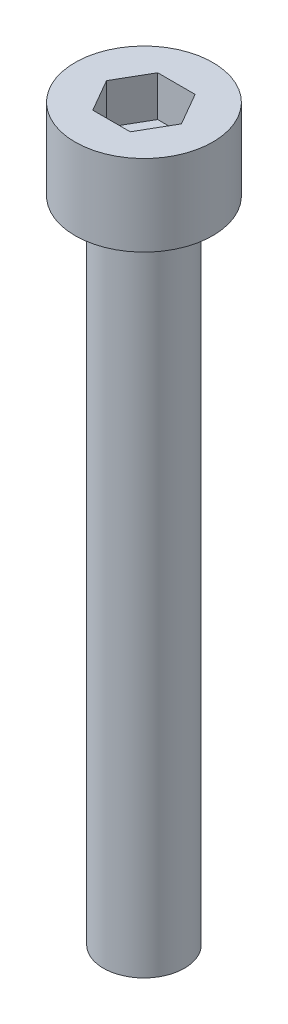
ISO-10303-21;
HEADER;
FILE_DESCRIPTION(('STEP AP214'),'2;1');
FILE_NAME('part.step','',(''),(''),'','','');
FILE_SCHEMA(('AUTOMOTIVE_DESIGN { 1 0 10303 214 1 1 1 1 }'));
ENDSEC;
DATA;
#1=APPLICATION_CONTEXT('core data for automotive mechanical design processes');
#2=APPLICATION_PROTOCOL_DEFINITION('international standard','automotive_design',2000,#1);
#3=PRODUCT_CONTEXT('',#1,'mechanical');
#4=PRODUCT('Part','Part','',(#3));
#5=PRODUCT_RELATED_PRODUCT_CATEGORY('part','',(#4));
#6=PRODUCT_DEFINITION_FORMATION('','',#4);
#7=PRODUCT_DEFINITION_CONTEXT('part definition',#1,'design');
#8=PRODUCT_DEFINITION('design','',#6,#7);
#9=PRODUCT_DEFINITION_SHAPE('','',#8);
#10=(LENGTH_UNIT() NAMED_UNIT(*) SI_UNIT(.MILLI.,.METRE.));
#11=(NAMED_UNIT(*) PLANE_ANGLE_UNIT() SI_UNIT($,.RADIAN.));
#12=(NAMED_UNIT(*) SI_UNIT($,.STERADIAN.) SOLID_ANGLE_UNIT());
#13=UNCERTAINTY_MEASURE_WITH_UNIT(LENGTH_MEASURE(1.E-05),#10,'distance_accuracy_value','');
#14=(GEOMETRIC_REPRESENTATION_CONTEXT(3) GLOBAL_UNCERTAINTY_ASSIGNED_CONTEXT((#13)) GLOBAL_UNIT_ASSIGNED_CONTEXT((#10,
#11,#12)) REPRESENTATION_CONTEXT('',''));
#15=CARTESIAN_POINT('',(0.,0.,0.));
#16=DIRECTION('',(0.,0.,1.));
#17=DIRECTION('',(1.,0.,0.));
#18=AXIS2_PLACEMENT_3D('',#15,#16,#17);
#19=CARTESIAN_POINT('',(0.,5.,0.));
#20=DIRECTION('',(0.,-1.,0.));
#21=DIRECTION('',(0.,0.,-1.));
#22=AXIS2_PLACEMENT_3D('',#19,#20,#21);
#23=CYLINDRICAL_SURFACE('',#22,4.25);
#24=CARTESIAN_POINT('',(0.,5.,0.));
#25=DIRECTION('',(0.,1.,0.));
#26=DIRECTION('',(0.,0.,1.));
#27=AXIS2_PLACEMENT_3D('',#24,#25,#26);
#28=CIRCLE('',#27,4.25);
#29=CARTESIAN_POINT('',(0.,5.,4.25));
#30=VERTEX_POINT('',#29);
#31=EDGE_CURVE('E43',#30,#30,#28,.T.);
#32=ORIENTED_EDGE('',*,*,#31,.F.);
#33=EDGE_LOOP('',(#32));
#34=FACE_BOUND('',#33,.T.);
#35=CARTESIAN_POINT('',(0.,0.,0.));
#36=DIRECTION('',(0.,1.,0.));
#37=DIRECTION('',(0.,0.,1.));
#38=AXIS2_PLACEMENT_3D('',#35,#36,#37);
#39=CIRCLE('',#38,4.25);
#40=CARTESIAN_POINT('',(0.,0.,4.25));
#41=VERTEX_POINT('',#40);
#42=EDGE_CURVE('E38',#41,#41,#39,.T.);
#43=ORIENTED_EDGE('',*,*,#42,.T.);
#44=EDGE_LOOP('',(#43));
#45=FACE_BOUND('',#44,.T.);
#46=ADVANCED_FACE('F35',(#34,#45),#23,.T.);
#47=CARTESIAN_POINT('',(0.,5.,0.));
#48=DIRECTION('',(0.,1.,0.));
#49=DIRECTION('',(0.,0.,1.));
#50=AXIS2_PLACEMENT_3D('',#47,#48,#49);
#51=PLANE('',#50);
#52=DIRECTION('',(0.5,0.,-0.866025403784439));
#53=VECTOR('',#52,1.);
#54=CARTESIAN_POINT('',(1.15470053837925,5.,2.));
#55=LINE('',#54,#53);
#56=CARTESIAN_POINT('',(1.15470053837925,5.,2.));
#57=VERTEX_POINT('',#56);
#58=CARTESIAN_POINT('',(2.3094010767585,5.,0.));
#59=VERTEX_POINT('',#58);
#60=EDGE_CURVE('E51',#57,#59,#55,.T.);
#61=ORIENTED_EDGE('',*,*,#60,.F.);
#62=DIRECTION('',(1.,0.,0.));
#63=VECTOR('',#62,1.);
#64=CARTESIAN_POINT('',(-1.15470053837925,5.,2.));
#65=LINE('',#64,#63);
#66=CARTESIAN_POINT('',(-1.15470053837925,5.,2.));
#67=VERTEX_POINT('',#66);
#68=EDGE_CURVE('E135',#67,#57,#65,.T.);
#69=ORIENTED_EDGE('',*,*,#68,.F.);
#70=DIRECTION('',(0.5,0.,0.866025403784438));
#71=VECTOR('',#70,1.);
#72=CARTESIAN_POINT('',(-2.3094010767585,5.,0.));
#73=LINE('',#72,#71);
#74=CARTESIAN_POINT('',(-2.3094010767585,5.,0.));
#75=VERTEX_POINT('',#74);
#76=EDGE_CURVE('E133',#75,#67,#73,.T.);
#77=ORIENTED_EDGE('',*,*,#76,.F.);
#78=DIRECTION('',(-0.5,0.,0.866025403784439));
#79=VECTOR('',#78,1.);
#80=CARTESIAN_POINT('',(-1.15470053837925,5.,-2.));
#81=LINE('',#80,#79);
#82=CARTESIAN_POINT('',(-1.15470053837925,5.,-2.));
#83=VERTEX_POINT('',#82);
#84=EDGE_CURVE('E99',#83,#75,#81,.T.);
#85=ORIENTED_EDGE('',*,*,#84,.F.);
#86=DIRECTION('',(-1.,0.,0.));
#87=VECTOR('',#86,1.);
#88=CARTESIAN_POINT('',(1.15470053837925,5.,-2.));
#89=LINE('',#88,#87);
#90=CARTESIAN_POINT('',(1.15470053837925,5.,-2.));
#91=VERTEX_POINT('',#90);
#92=EDGE_CURVE('E129',#91,#83,#89,.T.);
#93=ORIENTED_EDGE('',*,*,#92,.F.);
#94=DIRECTION('',(-0.5,0.,-0.866025403784438));
#95=VECTOR('',#94,1.);
#96=CARTESIAN_POINT('',(2.3094010767585,5.,0.));
#97=LINE('',#96,#95);
#98=EDGE_CURVE('E125',#59,#91,#97,.T.);
#99=ORIENTED_EDGE('',*,*,#98,.F.);
#100=EDGE_LOOP('',(#61,#69,#77,#85,#93,#99));
#101=FACE_BOUND('',#100,.T.);
#102=ORIENTED_EDGE('',*,*,#31,.T.);
#103=EDGE_LOOP('',(#102));
#104=FACE_BOUND('',#103,.T.);
#105=ADVANCED_FACE('F153',(#101,#104),#51,.T.);
#106=CARTESIAN_POINT('',(0.,0.,0.));
#107=DIRECTION('',(0.,1.,0.));
#108=DIRECTION('',(0.,0.,1.));
#109=AXIS2_PLACEMENT_3D('',#106,#107,#108);
#110=PLANE('',#109);
#111=CARTESIAN_POINT('',(0.,0.,0.));
#112=DIRECTION('',(0.,-1.,0.));
#113=DIRECTION('',(0.,0.,-1.));
#114=AXIS2_PLACEMENT_3D('',#111,#112,#113);
#115=CIRCLE('',#114,2.5);
#116=CARTESIAN_POINT('',(0.,0.,-2.5));
#117=VERTEX_POINT('',#116);
#118=EDGE_CURVE('E11',#117,#117,#115,.T.);
#119=ORIENTED_EDGE('',*,*,#118,.F.);
#120=EDGE_LOOP('',(#119));
#121=FACE_BOUND('',#120,.T.);
#122=ORIENTED_EDGE('',*,*,#42,.F.);
#123=EDGE_LOOP('',(#122));
#124=FACE_BOUND('',#123,.T.);
#125=ADVANCED_FACE('F150',(#121,#124),#110,.F.);
#126=CARTESIAN_POINT('',(1.15470053837925,2.5,2.));
#127=DIRECTION('',(0.866025403784439,0.,0.5));
#128=DIRECTION('',(0.5,0.,-0.866025403784439));
#129=AXIS2_PLACEMENT_3D('',#126,#127,#128);
#130=PLANE('',#129);
#131=ORIENTED_EDGE('',*,*,#60,.T.);
#132=DIRECTION('',(0.,1.,0.));
#133=VECTOR('',#132,1.);
#134=CARTESIAN_POINT('',(2.3094010767585,2.5,0.));
#135=LINE('',#134,#133);
#136=CARTESIAN_POINT('',(2.3094010767585,2.5,0.));
#137=VERTEX_POINT('',#136);
#138=EDGE_CURVE('E81',#137,#59,#135,.T.);
#139=ORIENTED_EDGE('',*,*,#138,.F.);
#140=DIRECTION('',(0.5,0.,-0.866025403784439));
#141=VECTOR('',#140,1.);
#142=CARTESIAN_POINT('',(1.15470053837925,2.5,2.));
#143=LINE('',#142,#141);
#144=CARTESIAN_POINT('',(1.15470053837925,2.5,2.));
#145=VERTEX_POINT('',#144);
#146=EDGE_CURVE('E137',#145,#137,#143,.T.);
#147=ORIENTED_EDGE('',*,*,#146,.F.);
#148=DIRECTION('',(0.,1.,0.));
#149=VECTOR('',#148,1.);
#150=CARTESIAN_POINT('',(1.15470053837925,2.5,2.));
#151=LINE('',#150,#149);
#152=EDGE_CURVE('E59',#145,#57,#151,.T.);
#153=ORIENTED_EDGE('',*,*,#152,.T.);
#154=EDGE_LOOP('',(#131,#139,#147,#153));
#155=FACE_BOUND('',#154,.T.);
#156=ADVANCED_FACE('F152',(#155),#130,.F.);
#157=CARTESIAN_POINT('',(-1.15470053837925,2.5,2.));
#158=DIRECTION('',(0.,0.,1.));
#159=DIRECTION('',(1.,0.,0.));
#160=AXIS2_PLACEMENT_3D('',#157,#158,#159);
#161=PLANE('',#160);
#162=ORIENTED_EDGE('',*,*,#68,.T.);
#163=ORIENTED_EDGE('',*,*,#152,.F.);
#164=DIRECTION('',(1.,0.,0.));
#165=VECTOR('',#164,1.);
#166=CARTESIAN_POINT('',(-1.15470053837925,2.5,2.));
#167=LINE('',#166,#165);
#168=CARTESIAN_POINT('',(-1.15470053837925,2.5,2.));
#169=VERTEX_POINT('',#168);
#170=EDGE_CURVE('E111',#169,#145,#167,.T.);
#171=ORIENTED_EDGE('',*,*,#170,.F.);
#172=DIRECTION('',(0.,1.,0.));
#173=VECTOR('',#172,1.);
#174=CARTESIAN_POINT('',(-1.15470053837925,2.5,2.));
#175=LINE('',#174,#173);
#176=EDGE_CURVE('E103',#169,#67,#175,.T.);
#177=ORIENTED_EDGE('',*,*,#176,.T.);
#178=EDGE_LOOP('',(#162,#163,#171,#177));
#179=FACE_BOUND('',#178,.T.);
#180=ADVANCED_FACE('F159',(#179),#161,.F.);
#181=CARTESIAN_POINT('',(-2.3094010767585,2.5,0.));
#182=DIRECTION('',(-0.866025403784439,0.,0.5));
#183=DIRECTION('',(0.5,0.,0.866025403784439));
#184=AXIS2_PLACEMENT_3D('',#181,#182,#183);
#185=PLANE('',#184);
#186=ORIENTED_EDGE('',*,*,#76,.T.);
#187=ORIENTED_EDGE('',*,*,#176,.F.);
#188=DIRECTION('',(0.5,0.,0.866025403784438));
#189=VECTOR('',#188,1.);
#190=CARTESIAN_POINT('',(-2.3094010767585,2.5,0.));
#191=LINE('',#190,#189);
#192=CARTESIAN_POINT('',(-2.3094010767585,2.5,0.));
#193=VERTEX_POINT('',#192);
#194=EDGE_CURVE('E107',#193,#169,#191,.T.);
#195=ORIENTED_EDGE('',*,*,#194,.F.);
#196=DIRECTION('',(0.,1.,0.));
#197=VECTOR('',#196,1.);
#198=CARTESIAN_POINT('',(-2.3094010767585,2.5,0.));
#199=LINE('',#198,#197);
#200=EDGE_CURVE('E92',#193,#75,#199,.T.);
#201=ORIENTED_EDGE('',*,*,#200,.T.);
#202=EDGE_LOOP('',(#186,#187,#195,#201));
#203=FACE_BOUND('',#202,.T.);
#204=ADVANCED_FACE('F108',(#203),#185,.F.);
#205=CARTESIAN_POINT('',(-1.15470053837925,2.5,-2.));
#206=DIRECTION('',(-0.866025403784439,0.,-0.5));
#207=DIRECTION('',(-0.5,0.,0.866025403784439));
#208=AXIS2_PLACEMENT_3D('',#205,#206,#207);
#209=PLANE('',#208);
#210=ORIENTED_EDGE('',*,*,#84,.T.);
#211=ORIENTED_EDGE('',*,*,#200,.F.);
#212=DIRECTION('',(-0.5,0.,0.866025403784439));
#213=VECTOR('',#212,1.);
#214=CARTESIAN_POINT('',(-1.15470053837925,2.5,-2.));
#215=LINE('',#214,#213);
#216=CARTESIAN_POINT('',(-1.15470053837925,2.5,-2.));
#217=VERTEX_POINT('',#216);
#218=EDGE_CURVE('E96',#217,#193,#215,.T.);
#219=ORIENTED_EDGE('',*,*,#218,.F.);
#220=DIRECTION('',(0.,1.,0.));
#221=VECTOR('',#220,1.);
#222=CARTESIAN_POINT('',(-1.15470053837925,2.5,-2.));
#223=LINE('',#222,#221);
#224=EDGE_CURVE('E104',#217,#83,#223,.T.);
#225=ORIENTED_EDGE('',*,*,#224,.T.);
#226=EDGE_LOOP('',(#210,#211,#219,#225));
#227=FACE_BOUND('',#226,.T.);
#228=ADVANCED_FACE('F94',(#227),#209,.F.);
#229=CARTESIAN_POINT('',(1.15470053837925,2.5,-2.));
#230=DIRECTION('',(0.,0.,-1.));
#231=DIRECTION('',(-1.,0.,0.));
#232=AXIS2_PLACEMENT_3D('',#229,#230,#231);
#233=PLANE('',#232);
#234=ORIENTED_EDGE('',*,*,#92,.T.);
#235=ORIENTED_EDGE('',*,*,#224,.F.);
#236=DIRECTION('',(-1.,0.,0.));
#237=VECTOR('',#236,1.);
#238=CARTESIAN_POINT('',(1.15470053837925,2.5,-2.));
#239=LINE('',#238,#237);
#240=CARTESIAN_POINT('',(1.15470053837925,2.5,-2.));
#241=VERTEX_POINT('',#240);
#242=EDGE_CURVE('E117',#241,#217,#239,.T.);
#243=ORIENTED_EDGE('',*,*,#242,.F.);
#244=DIRECTION('',(0.,1.,0.));
#245=VECTOR('',#244,1.);
#246=CARTESIAN_POINT('',(1.15470053837925,2.5,-2.));
#247=LINE('',#246,#245);
#248=EDGE_CURVE('E141',#241,#91,#247,.T.);
#249=ORIENTED_EDGE('',*,*,#248,.T.);
#250=EDGE_LOOP('',(#234,#235,#243,#249));
#251=FACE_BOUND('',#250,.T.);
#252=ADVANCED_FACE('F204',(#251),#233,.F.);
#253=CARTESIAN_POINT('',(2.3094010767585,2.5,0.));
#254=DIRECTION('',(0.866025403784438,0.,-0.5));
#255=DIRECTION('',(-0.5,0.,-0.866025403784439));
#256=AXIS2_PLACEMENT_3D('',#253,#254,#255);
#257=PLANE('',#256);
#258=ORIENTED_EDGE('',*,*,#98,.T.);
#259=ORIENTED_EDGE('',*,*,#248,.F.);
#260=DIRECTION('',(-0.5,0.,-0.866025403784438));
#261=VECTOR('',#260,1.);
#262=CARTESIAN_POINT('',(2.3094010767585,2.5,0.));
#263=LINE('',#262,#261);
#264=EDGE_CURVE('E119',#137,#241,#263,.T.);
#265=ORIENTED_EDGE('',*,*,#264,.F.);
#266=ORIENTED_EDGE('',*,*,#138,.T.);
#267=EDGE_LOOP('',(#258,#259,#265,#266));
#268=FACE_BOUND('',#267,.T.);
#269=ADVANCED_FACE('F213',(#268),#257,.F.);
#270=CARTESIAN_POINT('',(0.,2.5,0.));
#271=DIRECTION('',(0.,1.,0.));
#272=DIRECTION('',(0.,0.,1.));
#273=AXIS2_PLACEMENT_3D('',#270,#271,#272);
#274=PLANE('',#273);
#275=ORIENTED_EDGE('',*,*,#146,.T.);
#276=ORIENTED_EDGE('',*,*,#264,.T.);
#277=ORIENTED_EDGE('',*,*,#242,.T.);
#278=ORIENTED_EDGE('',*,*,#218,.T.);
#279=ORIENTED_EDGE('',*,*,#194,.T.);
#280=ORIENTED_EDGE('',*,*,#170,.T.);
#281=EDGE_LOOP('',(#275,#276,#277,#278,#279,#280));
#282=FACE_BOUND('',#281,.T.);
#283=ADVANCED_FACE('F114',(#282),#274,.T.);
#284=CARTESIAN_POINT('',(0.,-40.,0.));
#285=DIRECTION('',(0.,1.,0.));
#286=DIRECTION('',(0.,0.,1.));
#287=AXIS2_PLACEMENT_3D('',#284,#285,#286);
#288=CYLINDRICAL_SURFACE('',#287,2.5);
#289=CARTESIAN_POINT('',(0.,-40.,0.));
#290=DIRECTION('',(0.,-1.,0.));
#291=DIRECTION('',(0.,0.,-1.));
#292=AXIS2_PLACEMENT_3D('',#289,#290,#291);
#293=CIRCLE('',#292,2.5);
#294=CARTESIAN_POINT('',(0.,-40.,-2.5));
#295=VERTEX_POINT('',#294);
#296=EDGE_CURVE('E126',#295,#295,#293,.T.);
#297=ORIENTED_EDGE('',*,*,#296,.F.);
#298=EDGE_LOOP('',(#297));
#299=FACE_BOUND('',#298,.T.);
#300=ORIENTED_EDGE('',*,*,#118,.T.);
#301=EDGE_LOOP('',(#300));
#302=FACE_BOUND('',#301,.T.);
#303=ADVANCED_FACE('F231',(#299,#302),#288,.T.);
#304=CARTESIAN_POINT('',(0.,-40.,0.));
#305=DIRECTION('',(0.,-1.,0.));
#306=DIRECTION('',(0.,0.,-1.));
#307=AXIS2_PLACEMENT_3D('',#304,#305,#306);
#308=PLANE('',#307);
#309=ORIENTED_EDGE('',*,*,#296,.T.);
#310=EDGE_LOOP('',(#309));
#311=FACE_BOUND('',#310,.T.);
#312=ADVANCED_FACE('F244',(#311),#308,.T.);
#313=CLOSED_SHELL('',(#46,#105,#125,#156,#180,#204,#228,#252,#269,#283,#303,#312));
#314=MANIFOLD_SOLID_BREP('B2',#313);
#315=ADVANCED_BREP_SHAPE_REPRESENTATION('',(#18,#314),#14);
#316=SHAPE_DEFINITION_REPRESENTATION(#9,#315);
ENDSEC;
END-ISO-10303-21;
